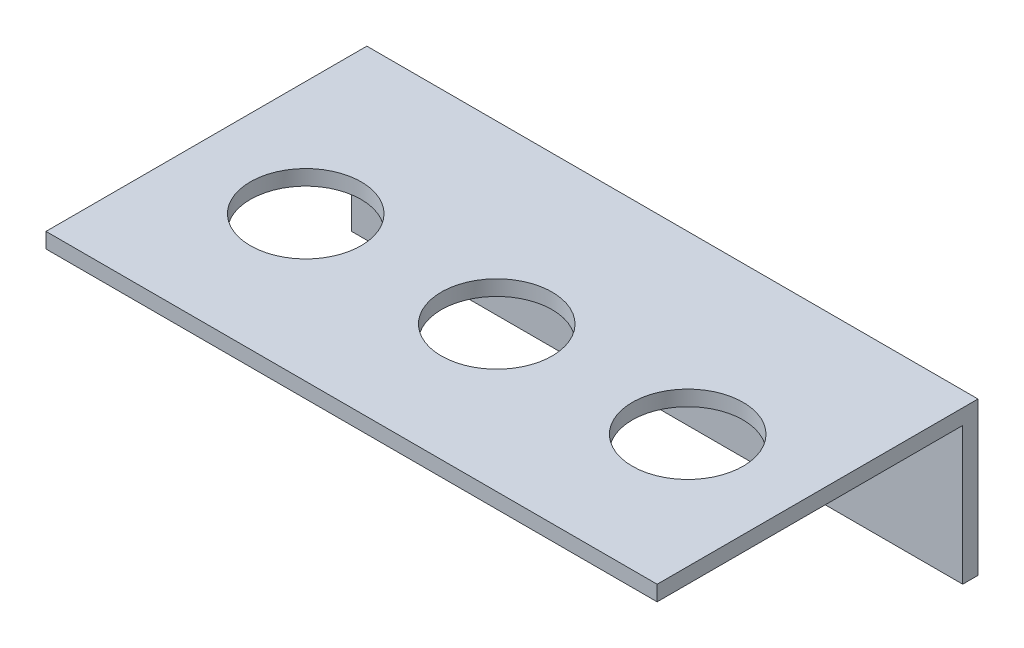
ISO-10303-21;
HEADER;
FILE_DESCRIPTION(('STEP AP214'),'2;1');
FILE_NAME('part.step','',(''),(''),'','','');
FILE_SCHEMA(('AUTOMOTIVE_DESIGN { 1 0 10303 214 1 1 1 1 }'));
ENDSEC;
DATA;
#1=APPLICATION_CONTEXT('core data for automotive mechanical design processes');
#2=APPLICATION_PROTOCOL_DEFINITION('international standard','automotive_design',2000,#1);
#3=PRODUCT_CONTEXT('',#1,'mechanical');
#4=PRODUCT('Part','Part','',(#3));
#5=PRODUCT_RELATED_PRODUCT_CATEGORY('part','',(#4));
#6=PRODUCT_DEFINITION_FORMATION('','',#4);
#7=PRODUCT_DEFINITION_CONTEXT('part definition',#1,'design');
#8=PRODUCT_DEFINITION('design','',#6,#7);
#9=PRODUCT_DEFINITION_SHAPE('','',#8);
#10=(LENGTH_UNIT() NAMED_UNIT(*) SI_UNIT(.MILLI.,.METRE.));
#11=(NAMED_UNIT(*) PLANE_ANGLE_UNIT() SI_UNIT($,.RADIAN.));
#12=(NAMED_UNIT(*) SI_UNIT($,.STERADIAN.) SOLID_ANGLE_UNIT());
#13=UNCERTAINTY_MEASURE_WITH_UNIT(LENGTH_MEASURE(1.E-05),#10,'distance_accuracy_value','');
#14=(GEOMETRIC_REPRESENTATION_CONTEXT(3) GLOBAL_UNCERTAINTY_ASSIGNED_CONTEXT((#13)) GLOBAL_UNIT_ASSIGNED_CONTEXT((#10,
#11,#12)) REPRESENTATION_CONTEXT('',''));
#15=CARTESIAN_POINT('',(0.,0.,0.));
#16=DIRECTION('',(0.,0.,1.));
#17=DIRECTION('',(1.,0.,0.));
#18=AXIS2_PLACEMENT_3D('',#15,#16,#17);
#19=CARTESIAN_POINT('',(40.,10.,42.));
#20=DIRECTION('',(-1.,0.,0.));
#21=DIRECTION('',(0.,0.,1.));
#22=AXIS2_PLACEMENT_3D('',#19,#20,#21);
#23=PLANE('',#22);
#24=DIRECTION('',(0.,1.,0.));
#25=VECTOR('',#24,1.);
#26=CARTESIAN_POINT('',(40.,10.,2.));
#27=LINE('',#26,#25);
#28=CARTESIAN_POINT('',(40.,-10.,2.));
#29=VERTEX_POINT('',#28);
#30=CARTESIAN_POINT('',(40.,8.,2.));
#31=VERTEX_POINT('',#30);
#32=EDGE_CURVE('E87',#29,#31,#27,.T.);
#33=ORIENTED_EDGE('',*,*,#32,.F.);
#34=DIRECTION('',(0.,0.,-1.));
#35=VECTOR('',#34,1.);
#36=CARTESIAN_POINT('',(40.,-10.,42.));
#37=LINE('',#36,#35);
#38=CARTESIAN_POINT('',(40.,-10.,0.));
#39=VERTEX_POINT('',#38);
#40=EDGE_CURVE('E80',#29,#39,#37,.T.);
#41=ORIENTED_EDGE('',*,*,#40,.T.);
#42=DIRECTION('',(0.,1.,0.));
#43=VECTOR('',#42,1.);
#44=CARTESIAN_POINT('',(40.,10.,0.));
#45=LINE('',#44,#43);
#46=CARTESIAN_POINT('',(40.,10.,0.));
#47=VERTEX_POINT('',#46);
#48=EDGE_CURVE('E84',#39,#47,#45,.T.);
#49=ORIENTED_EDGE('',*,*,#48,.T.);
#50=DIRECTION('',(0.,0.,-1.));
#51=VECTOR('',#50,1.);
#52=CARTESIAN_POINT('',(40.,10.,42.));
#53=LINE('',#52,#51);
#54=CARTESIAN_POINT('',(40.,10.,42.));
#55=VERTEX_POINT('',#54);
#56=EDGE_CURVE('E11',#55,#47,#53,.T.);
#57=ORIENTED_EDGE('',*,*,#56,.F.);
#58=DIRECTION('',(0.,1.,0.));
#59=VECTOR('',#58,1.);
#60=CARTESIAN_POINT('',(40.,10.,42.));
#61=LINE('',#60,#59);
#62=CARTESIAN_POINT('',(40.,8.,42.));
#63=VERTEX_POINT('',#62);
#64=EDGE_CURVE('E100',#63,#55,#61,.T.);
#65=ORIENTED_EDGE('',*,*,#64,.F.);
#66=DIRECTION('',(0.,0.,-1.));
#67=VECTOR('',#66,1.);
#68=CARTESIAN_POINT('',(40.,8.,42.));
#69=LINE('',#68,#67);
#70=EDGE_CURVE('E51',#63,#31,#69,.T.);
#71=ORIENTED_EDGE('',*,*,#70,.T.);
#72=EDGE_LOOP('',(#33,#41,#49,#57,#65,#71));
#73=FACE_BOUND('',#72,.T.);
#74=ADVANCED_FACE('F35',(#73),#23,.F.);
#75=CARTESIAN_POINT('',(-40.,10.,42.));
#76=DIRECTION('',(1.,0.,0.));
#77=DIRECTION('',(0.,0.,-1.));
#78=AXIS2_PLACEMENT_3D('',#75,#76,#77);
#79=PLANE('',#78);
#80=DIRECTION('',(0.,-1.,0.));
#81=VECTOR('',#80,1.);
#82=CARTESIAN_POINT('',(-40.,10.,2.));
#83=LINE('',#82,#81);
#84=CARTESIAN_POINT('',(-40.,8.,2.));
#85=VERTEX_POINT('',#84);
#86=CARTESIAN_POINT('',(-40.,-10.,2.));
#87=VERTEX_POINT('',#86);
#88=EDGE_CURVE('E132',#85,#87,#83,.T.);
#89=ORIENTED_EDGE('',*,*,#88,.F.);
#90=DIRECTION('',(0.,0.,-1.));
#91=VECTOR('',#90,1.);
#92=CARTESIAN_POINT('',(-40.,8.,42.));
#93=LINE('',#92,#91);
#94=CARTESIAN_POINT('',(-40.,8.,42.));
#95=VERTEX_POINT('',#94);
#96=EDGE_CURVE('E107',#95,#85,#93,.T.);
#97=ORIENTED_EDGE('',*,*,#96,.F.);
#98=DIRECTION('',(0.,-1.,0.));
#99=VECTOR('',#98,1.);
#100=CARTESIAN_POINT('',(-40.,10.,42.));
#101=LINE('',#100,#99);
#102=CARTESIAN_POINT('',(-40.,10.,42.));
#103=VERTEX_POINT('',#102);
#104=EDGE_CURVE('E91',#103,#95,#101,.T.);
#105=ORIENTED_EDGE('',*,*,#104,.F.);
#106=DIRECTION('',(0.,0.,-1.));
#107=VECTOR('',#106,1.);
#108=CARTESIAN_POINT('',(-40.,10.,42.));
#109=LINE('',#108,#107);
#110=CARTESIAN_POINT('',(-40.,10.,0.));
#111=VERTEX_POINT('',#110);
#112=EDGE_CURVE('E43',#103,#111,#109,.T.);
#113=ORIENTED_EDGE('',*,*,#112,.T.);
#114=DIRECTION('',(0.,-1.,0.));
#115=VECTOR('',#114,1.);
#116=CARTESIAN_POINT('',(-40.,10.,0.));
#117=LINE('',#116,#115);
#118=CARTESIAN_POINT('',(-40.,-10.,0.));
#119=VERTEX_POINT('',#118);
#120=EDGE_CURVE('E101',#111,#119,#117,.T.);
#121=ORIENTED_EDGE('',*,*,#120,.T.);
#122=DIRECTION('',(0.,0.,-1.));
#123=VECTOR('',#122,1.);
#124=CARTESIAN_POINT('',(-40.,-10.,42.));
#125=LINE('',#124,#123);
#126=EDGE_CURVE('E90',#87,#119,#125,.T.);
#127=ORIENTED_EDGE('',*,*,#126,.F.);
#128=EDGE_LOOP('',(#89,#97,#105,#113,#121,#127));
#129=FACE_BOUND('',#128,.T.);
#130=ADVANCED_FACE('F146',(#129),#79,.F.);
#131=CARTESIAN_POINT('',(-40.,-10.,42.));
#132=DIRECTION('',(0.,1.,0.));
#133=DIRECTION('',(0.,0.,1.));
#134=AXIS2_PLACEMENT_3D('',#131,#132,#133);
#135=PLANE('',#134);
#136=DIRECTION('',(1.,0.,0.));
#137=VECTOR('',#136,1.);
#138=CARTESIAN_POINT('',(-40.,-10.,2.));
#139=LINE('',#138,#137);
#140=EDGE_CURVE('E135',#87,#29,#139,.T.);
#141=ORIENTED_EDGE('',*,*,#140,.F.);
#142=ORIENTED_EDGE('',*,*,#126,.T.);
#143=DIRECTION('',(1.,0.,0.));
#144=VECTOR('',#143,1.);
#145=CARTESIAN_POINT('',(-40.,-10.,0.));
#146=LINE('',#145,#144);
#147=EDGE_CURVE('E94',#119,#39,#146,.T.);
#148=ORIENTED_EDGE('',*,*,#147,.T.);
#149=ORIENTED_EDGE('',*,*,#40,.F.);
#150=EDGE_LOOP('',(#141,#142,#148,#149));
#151=FACE_BOUND('',#150,.T.);
#152=ADVANCED_FACE('F95',(#151),#135,.F.);
#153=CARTESIAN_POINT('',(-40.,10.,42.));
#154=DIRECTION('',(0.,-1.,0.));
#155=DIRECTION('',(0.,0.,-1.));
#156=AXIS2_PLACEMENT_3D('',#153,#154,#155);
#157=PLANE('',#156);
#158=CARTESIAN_POINT('',(25.,10.,23.));
#159=DIRECTION('',(0.,1.,0.));
#160=DIRECTION('',(0.,0.,1.));
#161=AXIS2_PLACEMENT_3D('',#158,#159,#160);
#162=CIRCLE('',#161,7.25);
#163=CARTESIAN_POINT('',(25.,10.,30.25));
#164=VERTEX_POINT('',#163);
#165=EDGE_CURVE('E190',#164,#164,#162,.T.);
#166=ORIENTED_EDGE('',*,*,#165,.F.);
#167=EDGE_LOOP('',(#166));
#168=FACE_BOUND('',#167,.T.);
#169=CARTESIAN_POINT('',(-25.,10.,23.));
#170=DIRECTION('',(0.,1.,0.));
#171=DIRECTION('',(0.,0.,1.));
#172=AXIS2_PLACEMENT_3D('',#169,#170,#171);
#173=CIRCLE('',#172,7.25);
#174=CARTESIAN_POINT('',(-25.,10.,30.25));
#175=VERTEX_POINT('',#174);
#176=EDGE_CURVE('E194',#175,#175,#173,.T.);
#177=ORIENTED_EDGE('',*,*,#176,.F.);
#178=EDGE_LOOP('',(#177));
#179=FACE_BOUND('',#178,.T.);
#180=CARTESIAN_POINT('',(0.,10.,23.));
#181=DIRECTION('',(0.,1.,0.));
#182=DIRECTION('',(0.,0.,1.));
#183=AXIS2_PLACEMENT_3D('',#180,#181,#182);
#184=CIRCLE('',#183,7.25);
#185=CARTESIAN_POINT('',(0.,10.,30.25));
#186=VERTEX_POINT('',#185);
#187=EDGE_CURVE('E119',#186,#186,#184,.T.);
#188=ORIENTED_EDGE('',*,*,#187,.F.);
#189=EDGE_LOOP('',(#188));
#190=FACE_BOUND('',#189,.T.);
#191=DIRECTION('',(-1.,0.,0.));
#192=VECTOR('',#191,1.);
#193=CARTESIAN_POINT('',(-40.,10.,0.));
#194=LINE('',#193,#192);
#195=EDGE_CURVE('E104',#47,#111,#194,.T.);
#196=ORIENTED_EDGE('',*,*,#195,.T.);
#197=ORIENTED_EDGE('',*,*,#112,.F.);
#198=DIRECTION('',(-1.,0.,0.));
#199=VECTOR('',#198,1.);
#200=CARTESIAN_POINT('',(-40.,10.,42.));
#201=LINE('',#200,#199);
#202=EDGE_CURVE('E60',#55,#103,#201,.T.);
#203=ORIENTED_EDGE('',*,*,#202,.F.);
#204=ORIENTED_EDGE('',*,*,#56,.T.);
#205=EDGE_LOOP('',(#196,#197,#203,#204));
#206=FACE_BOUND('',#205,.T.);
#207=ADVANCED_FACE('F179',(#168,#179,#190,#206),#157,.F.);
#208=CARTESIAN_POINT('',(0.,0.,42.));
#209=DIRECTION('',(0.,0.,1.));
#210=DIRECTION('',(1.,0.,0.));
#211=AXIS2_PLACEMENT_3D('',#208,#209,#210);
#212=PLANE('',#211);
#213=DIRECTION('',(-1.,0.,0.));
#214=VECTOR('',#213,1.);
#215=CARTESIAN_POINT('',(-40.,8.,42.));
#216=LINE('',#215,#214);
#217=EDGE_CURVE('E138',#63,#95,#216,.T.);
#218=ORIENTED_EDGE('',*,*,#217,.F.);
#219=ORIENTED_EDGE('',*,*,#64,.T.);
#220=ORIENTED_EDGE('',*,*,#202,.T.);
#221=ORIENTED_EDGE('',*,*,#104,.T.);
#222=EDGE_LOOP('',(#218,#219,#220,#221));
#223=FACE_BOUND('',#222,.T.);
#224=ADVANCED_FACE('F141',(#223),#212,.T.);
#225=CARTESIAN_POINT('',(0.,0.,0.));
#226=DIRECTION('',(0.,0.,1.));
#227=DIRECTION('',(1.,0.,0.));
#228=AXIS2_PLACEMENT_3D('',#225,#226,#227);
#229=PLANE('',#228);
#230=ORIENTED_EDGE('',*,*,#48,.F.);
#231=ORIENTED_EDGE('',*,*,#147,.F.);
#232=ORIENTED_EDGE('',*,*,#120,.F.);
#233=ORIENTED_EDGE('',*,*,#195,.F.);
#234=EDGE_LOOP('',(#230,#231,#232,#233));
#235=FACE_BOUND('',#234,.T.);
#236=ADVANCED_FACE('F103',(#235),#229,.F.);
#237=CARTESIAN_POINT('',(-40.,8.,42.));
#238=DIRECTION('',(0.,-1.,0.));
#239=DIRECTION('',(0.,0.,-1.));
#240=AXIS2_PLACEMENT_3D('',#237,#238,#239);
#241=PLANE('',#240);
#242=CARTESIAN_POINT('',(25.,7.99999999999999,23.));
#243=DIRECTION('',(0.,-1.,0.));
#244=DIRECTION('',(0.,0.,-1.));
#245=AXIS2_PLACEMENT_3D('',#242,#243,#244);
#246=CIRCLE('',#245,7.25);
#247=CARTESIAN_POINT('',(25.,7.99999999999999,15.75));
#248=VERTEX_POINT('',#247);
#249=EDGE_CURVE('E38',#248,#248,#246,.T.);
#250=ORIENTED_EDGE('',*,*,#249,.F.);
#251=EDGE_LOOP('',(#250));
#252=FACE_BOUND('',#251,.T.);
#253=CARTESIAN_POINT('',(-25.,7.99999999999999,23.));
#254=DIRECTION('',(0.,-1.,0.));
#255=DIRECTION('',(0.,0.,-1.));
#256=AXIS2_PLACEMENT_3D('',#253,#254,#255);
#257=CIRCLE('',#256,7.25);
#258=CARTESIAN_POINT('',(-25.,7.99999999999999,15.75));
#259=VERTEX_POINT('',#258);
#260=EDGE_CURVE('E118',#259,#259,#257,.T.);
#261=ORIENTED_EDGE('',*,*,#260,.F.);
#262=EDGE_LOOP('',(#261));
#263=FACE_BOUND('',#262,.T.);
#264=CARTESIAN_POINT('',(0.,7.99999999999999,23.));
#265=DIRECTION('',(0.,-1.,0.));
#266=DIRECTION('',(0.,0.,-1.));
#267=AXIS2_PLACEMENT_3D('',#264,#265,#266);
#268=CIRCLE('',#267,7.25);
#269=CARTESIAN_POINT('',(0.,7.99999999999999,15.75));
#270=VERTEX_POINT('',#269);
#271=EDGE_CURVE('E116',#270,#270,#268,.T.);
#272=ORIENTED_EDGE('',*,*,#271,.F.);
#273=EDGE_LOOP('',(#272));
#274=FACE_BOUND('',#273,.T.);
#275=DIRECTION('',(-1.,0.,0.));
#276=VECTOR('',#275,1.);
#277=CARTESIAN_POINT('',(-40.,8.,2.));
#278=LINE('',#277,#276);
#279=EDGE_CURVE('E126',#31,#85,#278,.T.);
#280=ORIENTED_EDGE('',*,*,#279,.F.);
#281=ORIENTED_EDGE('',*,*,#70,.F.);
#282=ORIENTED_EDGE('',*,*,#217,.T.);
#283=ORIENTED_EDGE('',*,*,#96,.T.);
#284=EDGE_LOOP('',(#280,#281,#282,#283));
#285=FACE_BOUND('',#284,.T.);
#286=ADVANCED_FACE('F158',(#252,#263,#274,#285),#241,.T.);
#287=CARTESIAN_POINT('',(0.,0.,2.));
#288=DIRECTION('',(0.,0.,1.));
#289=DIRECTION('',(1.,0.,0.));
#290=AXIS2_PLACEMENT_3D('',#287,#288,#289);
#291=PLANE('',#290);
#292=ORIENTED_EDGE('',*,*,#32,.T.);
#293=ORIENTED_EDGE('',*,*,#279,.T.);
#294=ORIENTED_EDGE('',*,*,#88,.T.);
#295=ORIENTED_EDGE('',*,*,#140,.T.);
#296=EDGE_LOOP('',(#292,#293,#294,#295));
#297=FACE_BOUND('',#296,.T.);
#298=ADVANCED_FACE('F153',(#297),#291,.T.);
#299=CARTESIAN_POINT('',(0.,-32.,23.));
#300=DIRECTION('',(0.,1.,0.));
#301=DIRECTION('',(0.,0.,1.));
#302=AXIS2_PLACEMENT_3D('',#299,#300,#301);
#303=CYLINDRICAL_SURFACE('',#302,7.25);
#304=ORIENTED_EDGE('',*,*,#271,.T.);
#305=EDGE_LOOP('',(#304));
#306=FACE_BOUND('',#305,.T.);
#307=ORIENTED_EDGE('',*,*,#187,.T.);
#308=EDGE_LOOP('',(#307));
#309=FACE_BOUND('',#308,.T.);
#310=ADVANCED_FACE('F166',(#306,#309),#303,.F.);
#311=CARTESIAN_POINT('',(-25.,-32.,23.));
#312=DIRECTION('',(0.,1.,0.));
#313=DIRECTION('',(0.,0.,1.));
#314=AXIS2_PLACEMENT_3D('',#311,#312,#313);
#315=CYLINDRICAL_SURFACE('',#314,7.25);
#316=ORIENTED_EDGE('',*,*,#260,.T.);
#317=EDGE_LOOP('',(#316));
#318=FACE_BOUND('',#317,.T.);
#319=ORIENTED_EDGE('',*,*,#176,.T.);
#320=EDGE_LOOP('',(#319));
#321=FACE_BOUND('',#320,.T.);
#322=ADVANCED_FACE('F204',(#318,#321),#315,.F.);
#323=CARTESIAN_POINT('',(25.,-32.,23.));
#324=DIRECTION('',(0.,1.,0.));
#325=DIRECTION('',(0.,0.,1.));
#326=AXIS2_PLACEMENT_3D('',#323,#324,#325);
#327=CYLINDRICAL_SURFACE('',#326,7.25);
#328=ORIENTED_EDGE('',*,*,#249,.T.);
#329=EDGE_LOOP('',(#328));
#330=FACE_BOUND('',#329,.T.);
#331=ORIENTED_EDGE('',*,*,#165,.T.);
#332=EDGE_LOOP('',(#331));
#333=FACE_BOUND('',#332,.T.);
#334=ADVANCED_FACE('F202',(#330,#333),#327,.F.);
#335=CLOSED_SHELL('',(#74,#130,#152,#207,#224,#236,#286,#298,#310,#322,#334));
#336=MANIFOLD_SOLID_BREP('B2',#335);
#337=ADVANCED_BREP_SHAPE_REPRESENTATION('',(#18,#336),#14);
#338=SHAPE_DEFINITION_REPRESENTATION(#9,#337);
ENDSEC;
END-ISO-10303-21;
